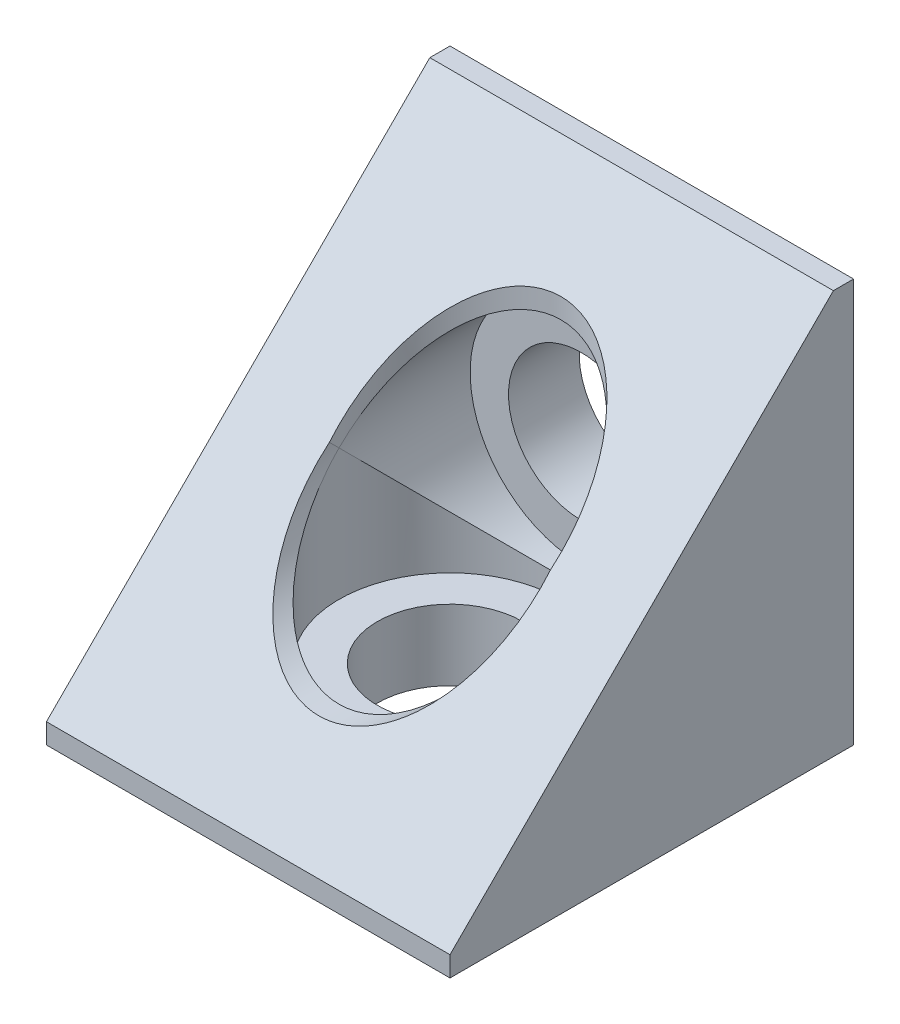
ISO-10303-21;
HEADER;
FILE_DESCRIPTION(('STEP AP214'),'2;1');
FILE_NAME('part.step','',(''),(''),'','','');
FILE_SCHEMA(('AUTOMOTIVE_DESIGN { 1 0 10303 214 1 1 1 1 }'));
ENDSEC;
DATA;
#1=APPLICATION_CONTEXT('core data for automotive mechanical design processes');
#2=APPLICATION_PROTOCOL_DEFINITION('international standard','automotive_design',2000,#1);
#3=PRODUCT_CONTEXT('',#1,'mechanical');
#4=PRODUCT('Part','Part','',(#3));
#5=PRODUCT_RELATED_PRODUCT_CATEGORY('part','',(#4));
#6=PRODUCT_DEFINITION_FORMATION('','',#4);
#7=PRODUCT_DEFINITION_CONTEXT('part definition',#1,'design');
#8=PRODUCT_DEFINITION('design','',#6,#7);
#9=PRODUCT_DEFINITION_SHAPE('','',#8);
#10=(LENGTH_UNIT() NAMED_UNIT(*) SI_UNIT(.MILLI.,.METRE.));
#11=(NAMED_UNIT(*) PLANE_ANGLE_UNIT() SI_UNIT($,.RADIAN.));
#12=(NAMED_UNIT(*) SI_UNIT($,.STERADIAN.) SOLID_ANGLE_UNIT());
#13=UNCERTAINTY_MEASURE_WITH_UNIT(LENGTH_MEASURE(1.E-05),#10,'distance_accuracy_value','');
#14=(GEOMETRIC_REPRESENTATION_CONTEXT(3) GLOBAL_UNCERTAINTY_ASSIGNED_CONTEXT((#13)) GLOBAL_UNIT_ASSIGNED_CONTEXT((#10,
#11,#12)) REPRESENTATION_CONTEXT('',''));
#15=CARTESIAN_POINT('',(0.,0.,0.));
#16=DIRECTION('',(0.,0.,1.));
#17=DIRECTION('',(1.,0.,0.));
#18=AXIS2_PLACEMENT_3D('',#15,#16,#17);
#19=CARTESIAN_POINT('',(0.,6.50000000000017,0.));
#20=DIRECTION('',(0.,-1.,0.));
#21=DIRECTION('',(0.,0.,-1.));
#22=AXIS2_PLACEMENT_3D('',#19,#20,#21);
#23=CYLINDRICAL_SURFACE('',#22,5.5);
#24=CARTESIAN_POINT('',(0.,-6.50000000000001,0.));
#25=DIRECTION('',(0.,-1.,0.));
#26=DIRECTION('',(0.,0.,-1.));
#27=AXIS2_PLACEMENT_3D('',#24,#25,#26);
#28=CIRCLE('',#27,5.5);
#29=CARTESIAN_POINT('',(0.,-6.50000000000001,-5.5));
#30=VERTEX_POINT('',#29);
#31=EDGE_CURVE('E162',#30,#30,#28,.T.);
#32=ORIENTED_EDGE('',*,*,#31,.T.);
#33=EDGE_LOOP('',(#32));
#34=FACE_BOUND('',#33,.T.);
#35=CARTESIAN_POINT('',(0.,0.,0.));
#36=DIRECTION('',(0.,-0.707106781186547,-0.707106781186547));
#37=DIRECTION('',(0.,-0.707106781186547,0.707106781186547));
#38=AXIS2_PLACEMENT_3D('',#35,#36,#37);
#39=ELLIPSE('',#38,7.77817459305203,5.5);
#40=CARTESIAN_POINT('',(-5.5,0.,0.));
#41=VERTEX_POINT('',#40);
#42=CARTESIAN_POINT('',(5.50000000000001,0.,0.));
#43=VERTEX_POINT('',#42);
#44=EDGE_CURVE('E45',#41,#43,#39,.F.);
#45=ORIENTED_EDGE('',*,*,#44,.T.);
#46=CARTESIAN_POINT('',(0.,0.,0.));
#47=DIRECTION('',(0.,-0.707106781186547,0.707106781186547));
#48=DIRECTION('',(0.,-0.707106781186547,-0.707106781186547));
#49=AXIS2_PLACEMENT_3D('',#46,#47,#48);
#50=ELLIPSE('',#49,7.77817459305203,5.5);
#51=EDGE_CURVE('E11',#43,#41,#50,.F.);
#52=ORIENTED_EDGE('',*,*,#51,.T.);
#53=EDGE_LOOP('',(#45,#52));
#54=FACE_BOUND('',#53,.T.);
#55=ADVANCED_FACE('F32',(#34,#54),#23,.F.);
#56=CARTESIAN_POINT('',(10.,-10.,10.));
#57=DIRECTION('',(0.,0.,1.));
#58=DIRECTION('',(0.,-1.,0.));
#59=AXIS2_PLACEMENT_3D('',#56,#57,#58);
#60=PLANE('',#59);
#61=DIRECTION('',(0.,1.,0.));
#62=VECTOR('',#61,1.);
#63=CARTESIAN_POINT('',(-10.,-10.,10.));
#64=LINE('',#63,#62);
#65=CARTESIAN_POINT('',(-10.,-10.,10.));
#66=VERTEX_POINT('',#65);
#67=CARTESIAN_POINT('',(-10.,-9.00000000000001,10.));
#68=VERTEX_POINT('',#67);
#69=EDGE_CURVE('E122',#66,#68,#64,.T.);
#70=ORIENTED_EDGE('',*,*,#69,.F.);
#71=DIRECTION('',(-1.,0.,0.));
#72=VECTOR('',#71,1.);
#73=CARTESIAN_POINT('',(10.,-10.,10.));
#74=LINE('',#73,#72);
#75=CARTESIAN_POINT('',(10.,-10.,10.));
#76=VERTEX_POINT('',#75);
#77=EDGE_CURVE('E54',#76,#66,#74,.T.);
#78=ORIENTED_EDGE('',*,*,#77,.F.);
#79=DIRECTION('',(0.,1.,0.));
#80=VECTOR('',#79,1.);
#81=CARTESIAN_POINT('',(10.,-10.,10.));
#82=LINE('',#81,#80);
#83=CARTESIAN_POINT('',(10.,-9.00000000000001,10.));
#84=VERTEX_POINT('',#83);
#85=EDGE_CURVE('E117',#76,#84,#82,.T.);
#86=ORIENTED_EDGE('',*,*,#85,.T.);
#87=DIRECTION('',(-1.,0.,0.));
#88=VECTOR('',#87,1.);
#89=CARTESIAN_POINT('',(10.,-9.00000000000001,10.));
#90=LINE('',#89,#88);
#91=EDGE_CURVE('E84',#84,#68,#90,.T.);
#92=ORIENTED_EDGE('',*,*,#91,.T.);
#93=EDGE_LOOP('',(#70,#78,#86,#92));
#94=FACE_BOUND('',#93,.T.);
#95=ADVANCED_FACE('F34',(#94),#60,.T.);
#96=CARTESIAN_POINT('',(10.,-10.,-10.));
#97=DIRECTION('',(0.,-1.,0.));
#98=DIRECTION('',(0.,0.,-1.));
#99=AXIS2_PLACEMENT_3D('',#96,#97,#98);
#100=PLANE('',#99);
#101=CARTESIAN_POINT('',(0.,-10.,0.));
#102=DIRECTION('',(0.,-1.,0.));
#103=DIRECTION('',(0.,0.,-1.));
#104=AXIS2_PLACEMENT_3D('',#101,#102,#103);
#105=CIRCLE('',#104,3.6);
#106=CARTESIAN_POINT('',(0.,-10.,-3.6));
#107=VERTEX_POINT('',#106);
#108=EDGE_CURVE('E141',#107,#107,#105,.T.);
#109=ORIENTED_EDGE('',*,*,#108,.F.);
#110=EDGE_LOOP('',(#109));
#111=FACE_BOUND('',#110,.T.);
#112=DIRECTION('',(0.,0.,1.));
#113=VECTOR('',#112,1.);
#114=CARTESIAN_POINT('',(-10.,-10.,-10.));
#115=LINE('',#114,#113);
#116=CARTESIAN_POINT('',(-10.,-10.,-10.));
#117=VERTEX_POINT('',#116);
#118=EDGE_CURVE('E132',#117,#66,#115,.T.);
#119=ORIENTED_EDGE('',*,*,#118,.F.);
#120=DIRECTION('',(-1.,0.,0.));
#121=VECTOR('',#120,1.);
#122=CARTESIAN_POINT('',(10.,-10.,-10.));
#123=LINE('',#122,#121);
#124=CARTESIAN_POINT('',(10.,-10.,-10.));
#125=VERTEX_POINT('',#124);
#126=EDGE_CURVE('E105',#125,#117,#123,.T.);
#127=ORIENTED_EDGE('',*,*,#126,.F.);
#128=DIRECTION('',(0.,0.,1.));
#129=VECTOR('',#128,1.);
#130=CARTESIAN_POINT('',(10.,-10.,-10.));
#131=LINE('',#130,#129);
#132=EDGE_CURVE('E112',#125,#76,#131,.T.);
#133=ORIENTED_EDGE('',*,*,#132,.T.);
#134=ORIENTED_EDGE('',*,*,#77,.T.);
#135=EDGE_LOOP('',(#119,#127,#133,#134));
#136=FACE_BOUND('',#135,.T.);
#137=ADVANCED_FACE('F189',(#111,#136),#100,.T.);
#138=CARTESIAN_POINT('',(10.,10.,-10.));
#139=DIRECTION('',(0.,0.,-1.));
#140=DIRECTION('',(-1.,0.,0.));
#141=AXIS2_PLACEMENT_3D('',#138,#139,#140);
#142=PLANE('',#141);
#143=CARTESIAN_POINT('',(0.,0.,-10.));
#144=DIRECTION('',(0.,0.,1.));
#145=DIRECTION('',(1.,0.,0.));
#146=AXIS2_PLACEMENT_3D('',#143,#144,#145);
#147=CIRCLE('',#146,3.60000000000001);
#148=CARTESIAN_POINT('',(3.60000000000001,0.,-10.));
#149=VERTEX_POINT('',#148);
#150=EDGE_CURVE('E163',#149,#149,#147,.T.);
#151=ORIENTED_EDGE('',*,*,#150,.T.);
#152=EDGE_LOOP('',(#151));
#153=FACE_BOUND('',#152,.T.);
#154=DIRECTION('',(0.,-1.,0.));
#155=VECTOR('',#154,1.);
#156=CARTESIAN_POINT('',(-10.,10.,-10.));
#157=LINE('',#156,#155);
#158=CARTESIAN_POINT('',(-10.,10.,-10.));
#159=VERTEX_POINT('',#158);
#160=EDGE_CURVE('E100',#159,#117,#157,.T.);
#161=ORIENTED_EDGE('',*,*,#160,.F.);
#162=DIRECTION('',(-1.,0.,0.));
#163=VECTOR('',#162,1.);
#164=CARTESIAN_POINT('',(10.,10.,-10.));
#165=LINE('',#164,#163);
#166=CARTESIAN_POINT('',(10.,10.,-10.));
#167=VERTEX_POINT('',#166);
#168=EDGE_CURVE('E94',#167,#159,#165,.T.);
#169=ORIENTED_EDGE('',*,*,#168,.F.);
#170=DIRECTION('',(0.,-1.,0.));
#171=VECTOR('',#170,1.);
#172=CARTESIAN_POINT('',(10.,10.,-10.));
#173=LINE('',#172,#171);
#174=EDGE_CURVE('E97',#167,#125,#173,.T.);
#175=ORIENTED_EDGE('',*,*,#174,.T.);
#176=ORIENTED_EDGE('',*,*,#126,.T.);
#177=EDGE_LOOP('',(#161,#169,#175,#176));
#178=FACE_BOUND('',#177,.T.);
#179=ADVANCED_FACE('F96',(#153,#178),#142,.T.);
#180=CARTESIAN_POINT('',(10.,9.99999999999999,-8.99999999999978));
#181=DIRECTION('',(0.,1.,0.));
#182=DIRECTION('',(0.,0.,1.));
#183=AXIS2_PLACEMENT_3D('',#180,#181,#182);
#184=PLANE('',#183);
#185=DIRECTION('',(0.,0.,-1.));
#186=VECTOR('',#185,1.);
#187=CARTESIAN_POINT('',(-10.,9.99999999999999,-8.99999999999978));
#188=LINE('',#187,#186);
#189=CARTESIAN_POINT('',(-10.,9.99999999999999,-8.99999999999978));
#190=VERTEX_POINT('',#189);
#191=EDGE_CURVE('E129',#190,#159,#188,.T.);
#192=ORIENTED_EDGE('',*,*,#191,.F.);
#193=DIRECTION('',(-1.,0.,0.));
#194=VECTOR('',#193,1.);
#195=CARTESIAN_POINT('',(10.,9.99999999999999,-8.99999999999978));
#196=LINE('',#195,#194);
#197=CARTESIAN_POINT('',(10.,9.99999999999999,-8.99999999999978));
#198=VERTEX_POINT('',#197);
#199=EDGE_CURVE('E106',#198,#190,#196,.T.);
#200=ORIENTED_EDGE('',*,*,#199,.F.);
#201=DIRECTION('',(0.,0.,-1.));
#202=VECTOR('',#201,1.);
#203=CARTESIAN_POINT('',(10.,9.99999999999999,-8.99999999999978));
#204=LINE('',#203,#202);
#205=EDGE_CURVE('E111',#198,#167,#204,.T.);
#206=ORIENTED_EDGE('',*,*,#205,.T.);
#207=ORIENTED_EDGE('',*,*,#168,.T.);
#208=EDGE_LOOP('',(#192,#200,#206,#207));
#209=FACE_BOUND('',#208,.T.);
#210=ADVANCED_FACE('F114',(#209),#184,.T.);
#211=CARTESIAN_POINT('',(10.,-9.00000000000001,10.));
#212=DIRECTION('',(0.,0.707106781186543,0.707106781186551));
#213=DIRECTION('',(0.,-0.707106781186552,0.707106781186544));
#214=AXIS2_PLACEMENT_3D('',#211,#212,#213);
#215=PLANE('',#214);
#216=CARTESIAN_POINT('',(0.,0.,1.0000000000001));
#217=DIRECTION('',(0.,0.707106781186543,0.707106781186551));
#218=DIRECTION('',(0.,-0.707106781186552,0.707106781186544));
#219=AXIS2_PLACEMENT_3D('',#216,#217,#218);
#220=ELLIPSE('',#219,7.77817459305199,5.50000000000001);
#221=CARTESIAN_POINT('',(-5.47722557505166,0.500000000000052,0.500000000000054));
#222=VERTEX_POINT('',#221);
#223=CARTESIAN_POINT('',(5.47722557505166,0.500000000000052,0.500000000000054));
#224=VERTEX_POINT('',#223);
#225=EDGE_CURVE('E161',#222,#224,#220,.T.);
#226=ORIENTED_EDGE('',*,*,#225,.F.);
#227=CARTESIAN_POINT('',(0.,1.00000000000011,0.));
#228=DIRECTION('',(0.,0.707106781186543,0.707106781186551));
#229=DIRECTION('',(0.,-0.707106781186552,0.707106781186544));
#230=AXIS2_PLACEMENT_3D('',#227,#228,#229);
#231=ELLIPSE('',#230,7.77817459305207,5.5);
#232=EDGE_CURVE('E126',#224,#222,#231,.T.);
#233=ORIENTED_EDGE('',*,*,#232,.F.);
#234=EDGE_LOOP('',(#226,#233));
#235=FACE_BOUND('',#234,.T.);
#236=DIRECTION('',(0.,0.707106781186552,-0.707106781186544));
#237=VECTOR('',#236,1.);
#238=CARTESIAN_POINT('',(-10.,-9.00000000000001,10.));
#239=LINE('',#238,#237);
#240=EDGE_CURVE('E125',#68,#190,#239,.T.);
#241=ORIENTED_EDGE('',*,*,#240,.F.);
#242=ORIENTED_EDGE('',*,*,#91,.F.);
#243=DIRECTION('',(0.,0.707106781186552,-0.707106781186544));
#244=VECTOR('',#243,1.);
#245=CARTESIAN_POINT('',(10.,-9.00000000000001,10.));
#246=LINE('',#245,#244);
#247=EDGE_CURVE('E115',#84,#198,#246,.T.);
#248=ORIENTED_EDGE('',*,*,#247,.T.);
#249=ORIENTED_EDGE('',*,*,#199,.T.);
#250=EDGE_LOOP('',(#241,#242,#248,#249));
#251=FACE_BOUND('',#250,.T.);
#252=ADVANCED_FACE('F160',(#235,#251),#215,.T.);
#253=CARTESIAN_POINT('',(10.,0.,0.));
#254=DIRECTION('',(-1.,0.,0.));
#255=DIRECTION('',(0.,0.,1.));
#256=AXIS2_PLACEMENT_3D('',#253,#254,#255);
#257=PLANE('',#256);
#258=ORIENTED_EDGE('',*,*,#85,.F.);
#259=ORIENTED_EDGE('',*,*,#132,.F.);
#260=ORIENTED_EDGE('',*,*,#174,.F.);
#261=ORIENTED_EDGE('',*,*,#205,.F.);
#262=ORIENTED_EDGE('',*,*,#247,.F.);
#263=EDGE_LOOP('',(#258,#259,#260,#261,#262));
#264=FACE_BOUND('',#263,.T.);
#265=ADVANCED_FACE('F110',(#264),#257,.F.);
#266=CARTESIAN_POINT('',(-10.,0.,0.));
#267=DIRECTION('',(-1.,0.,0.));
#268=DIRECTION('',(0.,0.,1.));
#269=AXIS2_PLACEMENT_3D('',#266,#267,#268);
#270=PLANE('',#269);
#271=ORIENTED_EDGE('',*,*,#69,.T.);
#272=ORIENTED_EDGE('',*,*,#240,.T.);
#273=ORIENTED_EDGE('',*,*,#191,.T.);
#274=ORIENTED_EDGE('',*,*,#160,.T.);
#275=ORIENTED_EDGE('',*,*,#118,.T.);
#276=EDGE_LOOP('',(#271,#272,#273,#274,#275));
#277=FACE_BOUND('',#276,.T.);
#278=ADVANCED_FACE('F195',(#277),#270,.T.);
#279=CARTESIAN_POINT('',(0.,0.,0.));
#280=DIRECTION('',(0.,-0.707106781186547,-0.707106781186547));
#281=DIRECTION('',(0.,-0.707106781186547,0.707106781186547));
#282=AXIS2_PLACEMENT_3D('',#279,#280,#281);
#283=ELLIPSE('',#282,7.77817459305203,5.5);
#284=EDGE_CURVE('E143',#41,#43,#283,.T.);
#285=ORIENTED_EDGE('',*,*,#284,.T.);
#286=CARTESIAN_POINT('',(0.,0.,0.));
#287=DIRECTION('',(0.,-0.707106781186547,0.707106781186547));
#288=DIRECTION('',(0.,-0.707106781186547,-0.707106781186547));
#289=AXIS2_PLACEMENT_3D('',#286,#287,#288);
#290=ELLIPSE('',#289,7.77817459305203,5.5);
#291=EDGE_CURVE('E40',#43,#224,#290,.T.);
#292=ORIENTED_EDGE('',*,*,#291,.T.);
#293=ORIENTED_EDGE('',*,*,#232,.T.);
#294=EDGE_CURVE('E145',#222,#41,#290,.T.);
#295=ORIENTED_EDGE('',*,*,#294,.T.);
#296=EDGE_LOOP('',(#285,#292,#293,#295));
#297=FACE_BOUND('',#296,.T.);
#298=ADVANCED_FACE('F152',(#297),#23,.F.);
#299=CARTESIAN_POINT('',(0.,6.50000000000017,0.));
#300=DIRECTION('',(0.,-1.,0.));
#301=DIRECTION('',(0.,0.,-1.));
#302=AXIS2_PLACEMENT_3D('',#299,#300,#301);
#303=CYLINDRICAL_SURFACE('',#302,3.6);
#304=CARTESIAN_POINT('',(0.,-6.50000000000001,0.));
#305=DIRECTION('',(0.,-1.,0.));
#306=DIRECTION('',(0.,0.,-1.));
#307=AXIS2_PLACEMENT_3D('',#304,#305,#306);
#308=CIRCLE('',#307,3.6);
#309=CARTESIAN_POINT('',(0.,-6.50000000000001,-3.6));
#310=VERTEX_POINT('',#309);
#311=EDGE_CURVE('E306',#310,#310,#308,.T.);
#312=ORIENTED_EDGE('',*,*,#311,.F.);
#313=EDGE_LOOP('',(#312));
#314=FACE_BOUND('',#313,.T.);
#315=ORIENTED_EDGE('',*,*,#108,.T.);
#316=EDGE_LOOP('',(#315));
#317=FACE_BOUND('',#316,.T.);
#318=ADVANCED_FACE('F194',(#314,#317),#303,.F.);
#319=CARTESIAN_POINT('',(0.,-6.5,-3.6));
#320=DIRECTION('',(0.,-1.,0.));
#321=DIRECTION('',(0.,0.,-1.));
#322=AXIS2_PLACEMENT_3D('',#319,#320,#321);
#323=PLANE('',#322);
#324=ORIENTED_EDGE('',*,*,#31,.F.);
#325=EDGE_LOOP('',(#324));
#326=FACE_BOUND('',#325,.T.);
#327=ORIENTED_EDGE('',*,*,#311,.T.);
#328=EDGE_LOOP('',(#327));
#329=FACE_BOUND('',#328,.T.);
#330=ADVANCED_FACE('F180',(#326,#329),#323,.F.);
#331=CARTESIAN_POINT('',(0.,0.,6.50000000000004));
#332=DIRECTION('',(0.,0.,1.));
#333=DIRECTION('',(1.,0.,0.));
#334=AXIS2_PLACEMENT_3D('',#331,#332,#333);
#335=CYLINDRICAL_SURFACE('',#334,5.50000000000001);
#336=ORIENTED_EDGE('',*,*,#225,.T.);
#337=ORIENTED_EDGE('',*,*,#291,.F.);
#338=ORIENTED_EDGE('',*,*,#44,.F.);
#339=ORIENTED_EDGE('',*,*,#294,.F.);
#340=EDGE_LOOP('',(#336,#337,#338,#339));
#341=FACE_BOUND('',#340,.T.);
#342=ADVANCED_FACE('F165',(#341),#335,.F.);
#343=CARTESIAN_POINT('',(0.,0.,-6.5));
#344=DIRECTION('',(0.,0.,1.));
#345=DIRECTION('',(1.,0.,0.));
#346=AXIS2_PLACEMENT_3D('',#343,#344,#345);
#347=CIRCLE('',#346,5.50000000000001);
#348=CARTESIAN_POINT('',(5.50000000000001,0.,-6.5));
#349=VERTEX_POINT('',#348);
#350=EDGE_CURVE('E299',#349,#349,#347,.T.);
#351=ORIENTED_EDGE('',*,*,#350,.F.);
#352=EDGE_LOOP('',(#351));
#353=FACE_BOUND('',#352,.T.);
#354=ORIENTED_EDGE('',*,*,#284,.F.);
#355=ORIENTED_EDGE('',*,*,#51,.F.);
#356=EDGE_LOOP('',(#354,#355));
#357=FACE_BOUND('',#356,.T.);
#358=ADVANCED_FACE('F168',(#353,#357),#335,.F.);
#359=CARTESIAN_POINT('',(0.,0.,6.50000000000004));
#360=DIRECTION('',(0.,0.,1.));
#361=DIRECTION('',(1.,0.,0.));
#362=AXIS2_PLACEMENT_3D('',#359,#360,#361);
#363=CYLINDRICAL_SURFACE('',#362,3.60000000000001);
#364=ORIENTED_EDGE('',*,*,#150,.F.);
#365=EDGE_LOOP('',(#364));
#366=FACE_BOUND('',#365,.T.);
#367=CARTESIAN_POINT('',(0.,0.,-6.5));
#368=DIRECTION('',(0.,0.,1.));
#369=DIRECTION('',(1.,0.,0.));
#370=AXIS2_PLACEMENT_3D('',#367,#368,#369);
#371=CIRCLE('',#370,3.60000000000001);
#372=CARTESIAN_POINT('',(3.60000000000001,0.,-6.5));
#373=VERTEX_POINT('',#372);
#374=EDGE_CURVE('E297',#373,#373,#371,.T.);
#375=ORIENTED_EDGE('',*,*,#374,.T.);
#376=EDGE_LOOP('',(#375));
#377=FACE_BOUND('',#376,.T.);
#378=ADVANCED_FACE('F170',(#366,#377),#363,.F.);
#379=CARTESIAN_POINT('',(3.60000000000001,0.,-6.5));
#380=DIRECTION('',(0.,0.,-1.));
#381=DIRECTION('',(-1.,0.,0.));
#382=AXIS2_PLACEMENT_3D('',#379,#380,#381);
#383=PLANE('',#382);
#384=ORIENTED_EDGE('',*,*,#374,.F.);
#385=EDGE_LOOP('',(#384));
#386=FACE_BOUND('',#385,.T.);
#387=ORIENTED_EDGE('',*,*,#350,.T.);
#388=EDGE_LOOP('',(#387));
#389=FACE_BOUND('',#388,.T.);
#390=ADVANCED_FACE('F177',(#386,#389),#383,.F.);
#391=CLOSED_SHELL('',(#55,#95,#137,#179,#210,#252,#265,#278,#298,#318,#330,#342,#358,#378,#390));
#392=MANIFOLD_SOLID_BREP('B2',#391);
#393=ADVANCED_BREP_SHAPE_REPRESENTATION('',(#18,#392),#14);
#394=SHAPE_DEFINITION_REPRESENTATION(#9,#393);
ENDSEC;
END-ISO-10303-21;
